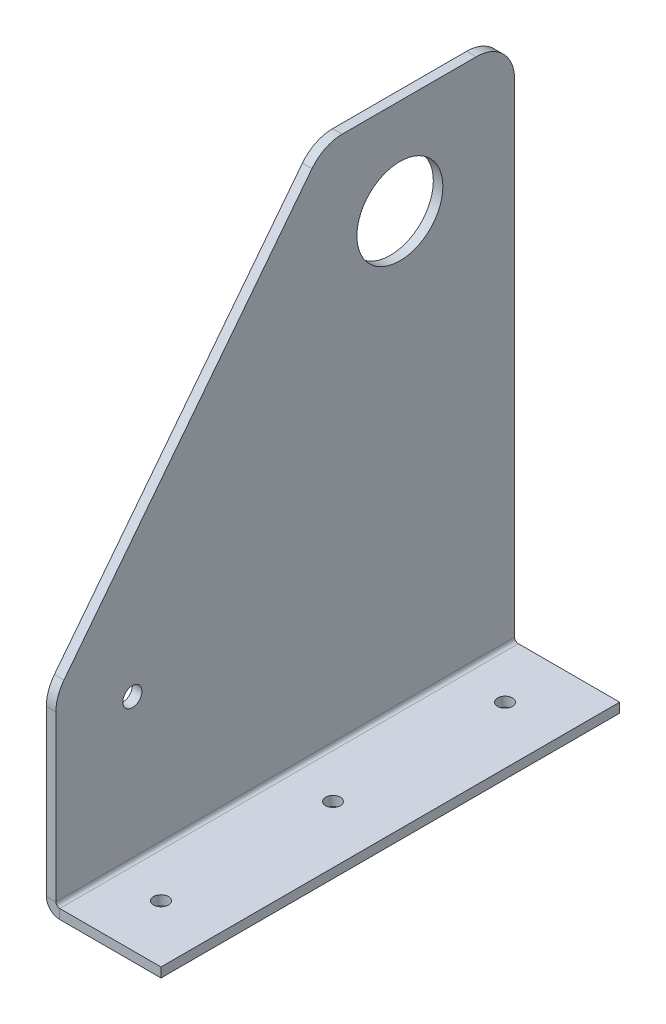
ISO-10303-21;
HEADER;
FILE_DESCRIPTION(('STEP AP214'),'2;1');
FILE_NAME('part.step','',(''),(''),'','','');
FILE_SCHEMA(('AUTOMOTIVE_DESIGN { 1 0 10303 214 1 1 1 1 }'));
ENDSEC;
DATA;
#1=APPLICATION_CONTEXT('core data for automotive mechanical design processes');
#2=APPLICATION_PROTOCOL_DEFINITION('international standard','automotive_design',2000,#1);
#3=PRODUCT_CONTEXT('',#1,'mechanical');
#4=PRODUCT('Part','Part','',(#3));
#5=PRODUCT_RELATED_PRODUCT_CATEGORY('part','',(#4));
#6=PRODUCT_DEFINITION_FORMATION('','',#4);
#7=PRODUCT_DEFINITION_CONTEXT('part definition',#1,'design');
#8=PRODUCT_DEFINITION('design','',#6,#7);
#9=PRODUCT_DEFINITION_SHAPE('','',#8);
#10=(LENGTH_UNIT() NAMED_UNIT(*) SI_UNIT(.MILLI.,.METRE.));
#11=(NAMED_UNIT(*) PLANE_ANGLE_UNIT() SI_UNIT($,.RADIAN.));
#12=(NAMED_UNIT(*) SI_UNIT($,.STERADIAN.) SOLID_ANGLE_UNIT());
#13=UNCERTAINTY_MEASURE_WITH_UNIT(LENGTH_MEASURE(1.E-05),#10,'distance_accuracy_value','');
#14=(GEOMETRIC_REPRESENTATION_CONTEXT(3) GLOBAL_UNCERTAINTY_ASSIGNED_CONTEXT((#13)) GLOBAL_UNIT_ASSIGNED_CONTEXT((#10,
#11,#12)) REPRESENTATION_CONTEXT('',''));
#15=CARTESIAN_POINT('',(0.,0.,0.));
#16=DIRECTION('',(0.,0.,1.));
#17=DIRECTION('',(1.,0.,0.));
#18=AXIS2_PLACEMENT_3D('',#15,#16,#17);
#19=CARTESIAN_POINT('',(0.,3.175,76.2));
#20=DIRECTION('',(0.,0.,-1.));
#21=DIRECTION('',(-1.,0.,0.));
#22=AXIS2_PLACEMENT_3D('',#19,#20,#21);
#23=PLANE('',#22);
#24=DIRECTION('',(0.,1.,0.));
#25=VECTOR('',#24,1.);
#26=CARTESIAN_POINT('',(4.445,3.175,76.2));
#27=LINE('',#26,#25);
#28=CARTESIAN_POINT('',(4.44499999999999,0.,76.2));
#29=VERTEX_POINT('',#28);
#30=CARTESIAN_POINT('',(4.445,3.175,76.2));
#31=VERTEX_POINT('',#30);
#32=EDGE_CURVE('E11',#29,#31,#27,.T.);
#33=ORIENTED_EDGE('',*,*,#32,.F.);
#34=DIRECTION('',(1.,0.,0.));
#35=VECTOR('',#34,1.);
#36=CARTESIAN_POINT('',(0.,0.,76.2));
#37=LINE('',#36,#35);
#38=CARTESIAN_POINT('',(38.1,0.,76.2));
#39=VERTEX_POINT('',#38);
#40=EDGE_CURVE('E100',#39,#29,#37,.F.);
#41=ORIENTED_EDGE('',*,*,#40,.F.);
#42=DIRECTION('',(0.,1.,0.));
#43=VECTOR('',#42,1.);
#44=CARTESIAN_POINT('',(38.1,3.175,76.2));
#45=LINE('',#44,#43);
#46=CARTESIAN_POINT('',(38.1,3.175,76.2));
#47=VERTEX_POINT('',#46);
#48=EDGE_CURVE('E49',#39,#47,#45,.T.);
#49=ORIENTED_EDGE('',*,*,#48,.T.);
#50=DIRECTION('',(-1.,0.,0.));
#51=VECTOR('',#50,1.);
#52=CARTESIAN_POINT('',(0.,3.175,76.2));
#53=LINE('',#52,#51);
#54=EDGE_CURVE('E102',#47,#31,#53,.T.);
#55=ORIENTED_EDGE('',*,*,#54,.T.);
#56=EDGE_LOOP('',(#33,#41,#49,#55));
#57=FACE_BOUND('',#56,.T.);
#58=ADVANCED_FACE('F39',(#57),#23,.F.);
#59=CARTESIAN_POINT('',(38.1,3.175,-76.2));
#60=DIRECTION('',(-1.,0.,0.));
#61=DIRECTION('',(0.,0.,1.));
#62=AXIS2_PLACEMENT_3D('',#59,#60,#61);
#63=PLANE('',#62);
#64=ORIENTED_EDGE('',*,*,#48,.F.);
#65=DIRECTION('',(0.,0.,1.));
#66=VECTOR('',#65,1.);
#67=CARTESIAN_POINT('',(38.1,0.,-76.2));
#68=LINE('',#67,#66);
#69=CARTESIAN_POINT('',(38.1,0.,-76.2));
#70=VERTEX_POINT('',#69);
#71=EDGE_CURVE('E126',#70,#39,#68,.T.);
#72=ORIENTED_EDGE('',*,*,#71,.F.);
#73=DIRECTION('',(0.,1.,0.));
#74=VECTOR('',#73,1.);
#75=CARTESIAN_POINT('',(38.1,3.175,-76.2));
#76=LINE('',#75,#74);
#77=CARTESIAN_POINT('',(38.1,3.175,-76.2));
#78=VERTEX_POINT('',#77);
#79=EDGE_CURVE('E174',#70,#78,#76,.T.);
#80=ORIENTED_EDGE('',*,*,#79,.T.);
#81=DIRECTION('',(0.,0.,1.));
#82=VECTOR('',#81,1.);
#83=CARTESIAN_POINT('',(38.1,3.175,-76.2));
#84=LINE('',#83,#82);
#85=EDGE_CURVE('E186',#78,#47,#84,.T.);
#86=ORIENTED_EDGE('',*,*,#85,.T.);
#87=EDGE_LOOP('',(#64,#72,#80,#86));
#88=FACE_BOUND('',#87,.T.);
#89=ADVANCED_FACE('F192',(#88),#63,.F.);
#90=CARTESIAN_POINT('',(0.,3.175,-76.2));
#91=DIRECTION('',(0.,0.,-1.));
#92=DIRECTION('',(-1.,0.,0.));
#93=AXIS2_PLACEMENT_3D('',#90,#91,#92);
#94=PLANE('',#93);
#95=ORIENTED_EDGE('',*,*,#79,.F.);
#96=DIRECTION('',(1.,0.,0.));
#97=VECTOR('',#96,1.);
#98=CARTESIAN_POINT('',(0.,0.,-76.2));
#99=LINE('',#98,#97);
#100=CARTESIAN_POINT('',(4.445,0.,-76.2));
#101=VERTEX_POINT('',#100);
#102=EDGE_CURVE('E127',#70,#101,#99,.F.);
#103=ORIENTED_EDGE('',*,*,#102,.T.);
#104=DIRECTION('',(0.,1.,0.));
#105=VECTOR('',#104,1.);
#106=CARTESIAN_POINT('',(4.445,3.175,-76.2));
#107=LINE('',#106,#105);
#108=CARTESIAN_POINT('',(4.445,3.175,-76.2));
#109=VERTEX_POINT('',#108);
#110=EDGE_CURVE('E171',#101,#109,#107,.T.);
#111=ORIENTED_EDGE('',*,*,#110,.T.);
#112=DIRECTION('',(-1.,0.,0.));
#113=VECTOR('',#112,1.);
#114=CARTESIAN_POINT('',(0.,3.175,-76.2));
#115=LINE('',#114,#113);
#116=EDGE_CURVE('E190',#78,#109,#115,.T.);
#117=ORIENTED_EDGE('',*,*,#116,.F.);
#118=EDGE_LOOP('',(#95,#103,#111,#117));
#119=FACE_BOUND('',#118,.T.);
#120=ADVANCED_FACE('F251',(#119),#94,.T.);
#121=CARTESIAN_POINT('',(4.445,4.445,-76.2));
#122=DIRECTION('',(0.,0.,-1.));
#123=DIRECTION('',(0.,1.,0.));
#124=AXIS2_PLACEMENT_3D('',#121,#122,#123);
#125=PLANE('',#124);
#126=ORIENTED_EDGE('',*,*,#110,.F.);
#127=CARTESIAN_POINT('',(4.445,4.445,-76.2));
#128=DIRECTION('',(0.,0.,-1.));
#129=DIRECTION('',(-1.,0.,0.));
#130=AXIS2_PLACEMENT_3D('',#127,#128,#129);
#131=CIRCLE('',#130,4.445);
#132=CARTESIAN_POINT('',(0.,4.44500000000001,-76.2));
#133=VERTEX_POINT('',#132);
#134=EDGE_CURVE('E116',#101,#133,#131,.T.);
#135=ORIENTED_EDGE('',*,*,#134,.T.);
#136=DIRECTION('',(1.,0.,0.));
#137=VECTOR('',#136,1.);
#138=CARTESIAN_POINT('',(3.175,4.445,-76.2));
#139=LINE('',#138,#137);
#140=CARTESIAN_POINT('',(3.175,4.445,-76.2));
#141=VERTEX_POINT('',#140);
#142=EDGE_CURVE('E169',#133,#141,#139,.T.);
#143=ORIENTED_EDGE('',*,*,#142,.T.);
#144=CARTESIAN_POINT('',(4.445,4.445,-76.2));
#145=DIRECTION('',(0.,0.,1.));
#146=DIRECTION('',(0.,-1.,0.));
#147=AXIS2_PLACEMENT_3D('',#144,#145,#146);
#148=CIRCLE('',#147,1.27);
#149=EDGE_CURVE('E226',#109,#141,#148,.F.);
#150=ORIENTED_EDGE('',*,*,#149,.F.);
#151=EDGE_LOOP('',(#126,#135,#143,#150));
#152=FACE_BOUND('',#151,.T.);
#153=ADVANCED_FACE('F304',(#152),#125,.T.);
#154=CARTESIAN_POINT('',(3.175,165.1,-76.2));
#155=DIRECTION('',(0.,0.,-1.));
#156=DIRECTION('',(0.,1.,0.));
#157=AXIS2_PLACEMENT_3D('',#154,#155,#156);
#158=PLANE('',#157);
#159=ORIENTED_EDGE('',*,*,#142,.F.);
#160=DIRECTION('',(0.,1.,0.));
#161=VECTOR('',#160,1.);
#162=CARTESIAN_POINT('',(0.,59.1425315732014,-76.2));
#163=LINE('',#162,#161);
#164=CARTESIAN_POINT('',(0.,165.1,-76.2));
#165=VERTEX_POINT('',#164);
#166=EDGE_CURVE('E247',#133,#165,#163,.T.);
#167=ORIENTED_EDGE('',*,*,#166,.T.);
#168=DIRECTION('',(1.,0.,0.));
#169=VECTOR('',#168,1.);
#170=CARTESIAN_POINT('',(3.175,165.1,-76.2));
#171=LINE('',#170,#169);
#172=CARTESIAN_POINT('',(3.175,165.1,-76.2));
#173=VERTEX_POINT('',#172);
#174=EDGE_CURVE('E166',#165,#173,#171,.T.);
#175=ORIENTED_EDGE('',*,*,#174,.T.);
#176=DIRECTION('',(0.,1.,0.));
#177=VECTOR('',#176,1.);
#178=CARTESIAN_POINT('',(3.175,165.1,-76.2));
#179=LINE('',#178,#177);
#180=EDGE_CURVE('E193',#141,#173,#179,.T.);
#181=ORIENTED_EDGE('',*,*,#180,.F.);
#182=EDGE_LOOP('',(#159,#167,#175,#181));
#183=FACE_BOUND('',#182,.T.);
#184=ADVANCED_FACE('F307',(#183),#158,.T.);
#185=CARTESIAN_POINT('',(3.175,165.1,-63.5));
#186=DIRECTION('',(1.,0.,0.));
#187=DIRECTION('',(0.,0.,-1.));
#188=AXIS2_PLACEMENT_3D('',#185,#186,#187);
#189=CYLINDRICAL_SURFACE('',#188,12.7);
#190=ORIENTED_EDGE('',*,*,#174,.F.);
#191=CARTESIAN_POINT('',(0.,165.1,-63.5));
#192=DIRECTION('',(1.,0.,0.));
#193=DIRECTION('',(0.,0.,-1.));
#194=AXIS2_PLACEMENT_3D('',#191,#192,#193);
#195=CIRCLE('',#194,12.7);
#196=CARTESIAN_POINT('',(0.,177.8,-63.4999999999999));
#197=VERTEX_POINT('',#196);
#198=EDGE_CURVE('E244',#165,#197,#195,.T.);
#199=ORIENTED_EDGE('',*,*,#198,.T.);
#200=DIRECTION('',(1.,0.,0.));
#201=VECTOR('',#200,1.);
#202=CARTESIAN_POINT('',(3.175,177.8,-63.4999999999999));
#203=LINE('',#202,#201);
#204=CARTESIAN_POINT('',(3.175,177.8,-63.4999999999999));
#205=VERTEX_POINT('',#204);
#206=EDGE_CURVE('E163',#197,#205,#203,.T.);
#207=ORIENTED_EDGE('',*,*,#206,.T.);
#208=CARTESIAN_POINT('',(3.175,165.1,-63.5));
#209=DIRECTION('',(1.,0.,0.));
#210=DIRECTION('',(0.,0.,1.));
#211=AXIS2_PLACEMENT_3D('',#208,#209,#210);
#212=CIRCLE('',#211,12.7);
#213=EDGE_CURVE('E196',#173,#205,#212,.T.);
#214=ORIENTED_EDGE('',*,*,#213,.F.);
#215=EDGE_LOOP('',(#190,#199,#207,#214));
#216=FACE_BOUND('',#215,.T.);
#217=ADVANCED_FACE('F311',(#216),#189,.T.);
#218=CARTESIAN_POINT('',(3.175,177.8,-18.9113643319545));
#219=DIRECTION('',(0.,1.,0.));
#220=DIRECTION('',(0.,0.,1.));
#221=AXIS2_PLACEMENT_3D('',#218,#219,#220);
#222=PLANE('',#221);
#223=ORIENTED_EDGE('',*,*,#206,.F.);
#224=DIRECTION('',(0.,0.,-1.));
#225=VECTOR('',#224,1.);
#226=CARTESIAN_POINT('',(0.,177.8,63.5));
#227=LINE('',#226,#225);
#228=CARTESIAN_POINT('',(0.,177.8,-18.9113643319545));
#229=VERTEX_POINT('',#228);
#230=EDGE_CURVE('E241',#197,#229,#227,.F.);
#231=ORIENTED_EDGE('',*,*,#230,.T.);
#232=DIRECTION('',(1.,0.,0.));
#233=VECTOR('',#232,1.);
#234=CARTESIAN_POINT('',(3.175,177.8,-18.9113643319545));
#235=LINE('',#234,#233);
#236=CARTESIAN_POINT('',(3.175,177.8,-18.9113643319545));
#237=VERTEX_POINT('',#236);
#238=EDGE_CURVE('E160',#229,#237,#235,.T.);
#239=ORIENTED_EDGE('',*,*,#238,.T.);
#240=DIRECTION('',(0.,0.,1.));
#241=VECTOR('',#240,1.);
#242=CARTESIAN_POINT('',(3.175,177.8,-18.9113643319545));
#243=LINE('',#242,#241);
#244=EDGE_CURVE('E202',#205,#237,#243,.T.);
#245=ORIENTED_EDGE('',*,*,#244,.F.);
#246=EDGE_LOOP('',(#223,#231,#239,#245));
#247=FACE_BOUND('',#246,.T.);
#248=ADVANCED_FACE('F315',(#247),#222,.T.);
#249=CARTESIAN_POINT('',(3.175,165.1,-18.9113643319545));
#250=DIRECTION('',(1.,0.,0.));
#251=DIRECTION('',(0.,0.,-1.));
#252=AXIS2_PLACEMENT_3D('',#249,#250,#251);
#253=CYLINDRICAL_SURFACE('',#252,12.7);
#254=ORIENTED_EDGE('',*,*,#238,.F.);
#255=CARTESIAN_POINT('',(0.,165.1,-18.9113643319545));
#256=DIRECTION('',(1.,0.,0.));
#257=DIRECTION('',(0.,0.,-1.));
#258=AXIS2_PLACEMENT_3D('',#255,#256,#257);
#259=CIRCLE('',#258,12.7);
#260=CARTESIAN_POINT('',(0.,172.897045791639,-8.8865911712751));
#261=VERTEX_POINT('',#260);
#262=EDGE_CURVE('E238',#229,#261,#259,.T.);
#263=ORIENTED_EDGE('',*,*,#262,.T.);
#264=DIRECTION('',(1.,0.,0.));
#265=VECTOR('',#264,1.);
#266=CARTESIAN_POINT('',(3.175,172.897045791639,-8.8865911712751));
#267=LINE('',#266,#265);
#268=CARTESIAN_POINT('',(3.175,172.897045791639,-8.8865911712751));
#269=VERTEX_POINT('',#268);
#270=EDGE_CURVE('E157',#261,#269,#267,.T.);
#271=ORIENTED_EDGE('',*,*,#270,.T.);
#272=CARTESIAN_POINT('',(3.175,165.1,-18.9113643319545));
#273=DIRECTION('',(1.,0.,0.));
#274=DIRECTION('',(0.,0.,-1.));
#275=AXIS2_PLACEMENT_3D('',#272,#273,#274);
#276=CIRCLE('',#275,12.7);
#277=EDGE_CURVE('E205',#237,#269,#276,.T.);
#278=ORIENTED_EDGE('',*,*,#277,.F.);
#279=EDGE_LOOP('',(#254,#263,#271,#278));
#280=FACE_BOUND('',#279,.T.);
#281=ADVANCED_FACE('F319',(#280),#253,.T.);
#282=CARTESIAN_POINT('',(3.175,66.9395773648409,73.5247731606793));
#283=DIRECTION('',(0.,0.61394061351492,0.789352217376326));
#284=DIRECTION('',(0.,-0.789352217376326,0.61394061351492));
#285=AXIS2_PLACEMENT_3D('',#282,#283,#284);
#286=PLANE('',#285);
#287=ORIENTED_EDGE('',*,*,#270,.F.);
#288=DIRECTION('',(0.,-0.789352217376326,0.61394061351492));
#289=VECTOR('',#288,1.);
#290=CARTESIAN_POINT('',(0.,66.9395773648409,73.5247731606793));
#291=LINE('',#290,#289);
#292=CARTESIAN_POINT('',(0.,66.9395773648409,73.5247731606793));
#293=VERTEX_POINT('',#292);
#294=EDGE_CURVE('E235',#261,#293,#291,.T.);
#295=ORIENTED_EDGE('',*,*,#294,.T.);
#296=DIRECTION('',(1.,0.,0.));
#297=VECTOR('',#296,1.);
#298=CARTESIAN_POINT('',(3.175,66.9395773648409,73.5247731606793));
#299=LINE('',#298,#297);
#300=CARTESIAN_POINT('',(3.175,66.9395773648409,73.5247731606793));
#301=VERTEX_POINT('',#300);
#302=EDGE_CURVE('E154',#293,#301,#299,.T.);
#303=ORIENTED_EDGE('',*,*,#302,.T.);
#304=DIRECTION('',(0.,-0.789352217376326,0.61394061351492));
#305=VECTOR('',#304,1.);
#306=CARTESIAN_POINT('',(3.175,66.9395773648409,73.5247731606793));
#307=LINE('',#306,#305);
#308=EDGE_CURVE('E208',#269,#301,#307,.T.);
#309=ORIENTED_EDGE('',*,*,#308,.F.);
#310=EDGE_LOOP('',(#287,#295,#303,#309));
#311=FACE_BOUND('',#310,.T.);
#312=ADVANCED_FACE('F323',(#311),#286,.T.);
#313=CARTESIAN_POINT('',(3.175,59.1425315732014,63.5));
#314=DIRECTION('',(1.,0.,0.));
#315=DIRECTION('',(0.,0.,-1.));
#316=AXIS2_PLACEMENT_3D('',#313,#314,#315);
#317=CYLINDRICAL_SURFACE('',#316,12.7);
#318=ORIENTED_EDGE('',*,*,#302,.F.);
#319=CARTESIAN_POINT('',(0.,59.1425315732014,63.5));
#320=DIRECTION('',(1.,0.,0.));
#321=DIRECTION('',(0.,0.,-1.));
#322=AXIS2_PLACEMENT_3D('',#319,#320,#321);
#323=CIRCLE('',#322,12.7);
#324=CARTESIAN_POINT('',(0.,59.1425315732013,76.2));
#325=VERTEX_POINT('',#324);
#326=EDGE_CURVE('E232',#293,#325,#323,.T.);
#327=ORIENTED_EDGE('',*,*,#326,.T.);
#328=DIRECTION('',(1.,0.,0.));
#329=VECTOR('',#328,1.);
#330=CARTESIAN_POINT('',(3.175,59.1425315732013,76.2));
#331=LINE('',#330,#329);
#332=CARTESIAN_POINT('',(3.175,59.1425315732013,76.2));
#333=VERTEX_POINT('',#332);
#334=EDGE_CURVE('E151',#325,#333,#331,.T.);
#335=ORIENTED_EDGE('',*,*,#334,.T.);
#336=CARTESIAN_POINT('',(3.175,59.1425315732014,63.5));
#337=DIRECTION('',(1.,0.,0.));
#338=DIRECTION('',(0.,0.,-1.));
#339=AXIS2_PLACEMENT_3D('',#336,#337,#338);
#340=CIRCLE('',#339,12.7);
#341=EDGE_CURVE('E211',#301,#333,#340,.T.);
#342=ORIENTED_EDGE('',*,*,#341,.F.);
#343=EDGE_LOOP('',(#318,#327,#335,#342));
#344=FACE_BOUND('',#343,.T.);
#345=ADVANCED_FACE('F327',(#344),#317,.T.);
#346=CARTESIAN_POINT('',(3.175,0.,76.2));
#347=DIRECTION('',(0.,0.,1.));
#348=DIRECTION('',(0.,-1.,0.));
#349=AXIS2_PLACEMENT_3D('',#346,#347,#348);
#350=PLANE('',#349);
#351=ORIENTED_EDGE('',*,*,#334,.F.);
#352=DIRECTION('',(0.,1.,0.));
#353=VECTOR('',#352,1.);
#354=CARTESIAN_POINT('',(0.,59.1425315732014,76.2));
#355=LINE('',#354,#353);
#356=CARTESIAN_POINT('',(0.,4.445,76.2));
#357=VERTEX_POINT('',#356);
#358=EDGE_CURVE('E142',#325,#357,#355,.F.);
#359=ORIENTED_EDGE('',*,*,#358,.T.);
#360=DIRECTION('',(1.,0.,0.));
#361=VECTOR('',#360,1.);
#362=CARTESIAN_POINT('',(3.175,4.445,76.2));
#363=LINE('',#362,#361);
#364=CARTESIAN_POINT('',(3.175,4.445,76.2));
#365=VERTEX_POINT('',#364);
#366=EDGE_CURVE('E43',#357,#365,#363,.T.);
#367=ORIENTED_EDGE('',*,*,#366,.T.);
#368=DIRECTION('',(0.,-1.,0.));
#369=VECTOR('',#368,1.);
#370=CARTESIAN_POINT('',(3.175,0.,76.2));
#371=LINE('',#370,#369);
#372=EDGE_CURVE('E214',#333,#365,#371,.T.);
#373=ORIENTED_EDGE('',*,*,#372,.F.);
#374=EDGE_LOOP('',(#351,#359,#367,#373));
#375=FACE_BOUND('',#374,.T.);
#376=ADVANCED_FACE('F331',(#375),#350,.T.);
#377=CARTESIAN_POINT('',(19.05,3.175,57.15));
#378=DIRECTION('',(0.,1.,0.));
#379=DIRECTION('',(0.,0.,1.));
#380=AXIS2_PLACEMENT_3D('',#377,#378,#379);
#381=CYLINDRICAL_SURFACE('',#380,2.45745);
#382=CARTESIAN_POINT('',(19.05,3.175,57.15));
#383=DIRECTION('',(0.,1.,0.));
#384=DIRECTION('',(0.,0.,1.));
#385=AXIS2_PLACEMENT_3D('',#382,#383,#384);
#386=CIRCLE('',#385,2.45745);
#387=CARTESIAN_POINT('',(19.05,3.175,59.60745));
#388=VERTEX_POINT('',#387);
#389=EDGE_CURVE('E229',#388,#388,#386,.T.);
#390=ORIENTED_EDGE('',*,*,#389,.T.);
#391=EDGE_LOOP('',(#390));
#392=FACE_BOUND('',#391,.T.);
#393=CARTESIAN_POINT('',(19.05,0.,57.15));
#394=DIRECTION('',(0.,1.,0.));
#395=DIRECTION('',(0.,0.,1.));
#396=AXIS2_PLACEMENT_3D('',#393,#394,#395);
#397=CIRCLE('',#396,2.45745);
#398=CARTESIAN_POINT('',(19.05,0.,59.60745));
#399=VERTEX_POINT('',#398);
#400=EDGE_CURVE('E133',#399,#399,#397,.T.);
#401=ORIENTED_EDGE('',*,*,#400,.F.);
#402=EDGE_LOOP('',(#401));
#403=FACE_BOUND('',#402,.T.);
#404=ADVANCED_FACE('F335',(#392,#403),#381,.F.);
#405=CARTESIAN_POINT('',(19.05,3.175,0.));
#406=DIRECTION('',(0.,1.,0.));
#407=DIRECTION('',(0.,0.,1.));
#408=AXIS2_PLACEMENT_3D('',#405,#406,#407);
#409=CYLINDRICAL_SURFACE('',#408,2.45745);
#410=CARTESIAN_POINT('',(19.05,3.175,0.));
#411=DIRECTION('',(0.,1.,0.));
#412=DIRECTION('',(0.,0.,1.));
#413=AXIS2_PLACEMENT_3D('',#410,#411,#412);
#414=CIRCLE('',#413,2.45745);
#415=CARTESIAN_POINT('',(19.05,3.175,2.45745));
#416=VERTEX_POINT('',#415);
#417=EDGE_CURVE('E258',#416,#416,#414,.T.);
#418=ORIENTED_EDGE('',*,*,#417,.T.);
#419=EDGE_LOOP('',(#418));
#420=FACE_BOUND('',#419,.T.);
#421=CARTESIAN_POINT('',(19.05,0.,0.));
#422=DIRECTION('',(0.,1.,0.));
#423=DIRECTION('',(0.,0.,1.));
#424=AXIS2_PLACEMENT_3D('',#421,#422,#423);
#425=CIRCLE('',#424,2.45745);
#426=CARTESIAN_POINT('',(19.05,0.,2.45745));
#427=VERTEX_POINT('',#426);
#428=EDGE_CURVE('E145',#427,#427,#425,.T.);
#429=ORIENTED_EDGE('',*,*,#428,.F.);
#430=EDGE_LOOP('',(#429));
#431=FACE_BOUND('',#430,.T.);
#432=ADVANCED_FACE('F418',(#420,#431),#409,.F.);
#433=CARTESIAN_POINT('',(19.05,3.175,-57.15));
#434=DIRECTION('',(0.,1.,0.));
#435=DIRECTION('',(0.,0.,1.));
#436=AXIS2_PLACEMENT_3D('',#433,#434,#435);
#437=CYLINDRICAL_SURFACE('',#436,2.45745);
#438=CARTESIAN_POINT('',(19.05,3.175,-57.15));
#439=DIRECTION('',(0.,1.,0.));
#440=DIRECTION('',(0.,0.,1.));
#441=AXIS2_PLACEMENT_3D('',#438,#439,#440);
#442=CIRCLE('',#441,2.45745);
#443=CARTESIAN_POINT('',(19.05,3.175,-54.69255));
#444=VERTEX_POINT('',#443);
#445=EDGE_CURVE('E256',#444,#444,#442,.T.);
#446=ORIENTED_EDGE('',*,*,#445,.T.);
#447=EDGE_LOOP('',(#446));
#448=FACE_BOUND('',#447,.T.);
#449=CARTESIAN_POINT('',(19.05,0.,-57.15));
#450=DIRECTION('',(0.,1.,0.));
#451=DIRECTION('',(0.,0.,1.));
#452=AXIS2_PLACEMENT_3D('',#449,#450,#451);
#453=CIRCLE('',#452,2.45745);
#454=CARTESIAN_POINT('',(19.05,0.,-54.69255));
#455=VERTEX_POINT('',#454);
#456=EDGE_CURVE('E148',#455,#455,#453,.T.);
#457=ORIENTED_EDGE('',*,*,#456,.F.);
#458=EDGE_LOOP('',(#457));
#459=FACE_BOUND('',#458,.T.);
#460=ADVANCED_FACE('F41',(#448,#459),#437,.F.);
#461=CARTESIAN_POINT('',(4.445,4.445,76.2));
#462=DIRECTION('',(0.,0.,-1.));
#463=DIRECTION('',(-1.,0.,0.));
#464=AXIS2_PLACEMENT_3D('',#461,#462,#463);
#465=PLANE('',#464);
#466=CARTESIAN_POINT('',(4.445,4.445,76.2));
#467=DIRECTION('',(0.,0.,-1.));
#468=DIRECTION('',(-1.,0.,0.));
#469=AXIS2_PLACEMENT_3D('',#466,#467,#468);
#470=CIRCLE('',#469,4.445);
#471=EDGE_CURVE('E114',#357,#29,#470,.F.);
#472=ORIENTED_EDGE('',*,*,#471,.T.);
#473=ORIENTED_EDGE('',*,*,#32,.T.);
#474=CARTESIAN_POINT('',(4.445,4.445,76.2));
#475=DIRECTION('',(0.,0.,1.));
#476=DIRECTION('',(1.,0.,0.));
#477=AXIS2_PLACEMENT_3D('',#474,#475,#476);
#478=CIRCLE('',#477,1.27);
#479=EDGE_CURVE('E224',#365,#31,#478,.T.);
#480=ORIENTED_EDGE('',*,*,#479,.F.);
#481=ORIENTED_EDGE('',*,*,#366,.F.);
#482=EDGE_LOOP('',(#472,#473,#480,#481));
#483=FACE_BOUND('',#482,.T.);
#484=ADVANCED_FACE('F129',(#483),#465,.F.);
#485=CARTESIAN_POINT('',(3.175,146.05,-38.1));
#486=DIRECTION('',(1.,0.,0.));
#487=DIRECTION('',(0.,0.,-1.));
#488=AXIS2_PLACEMENT_3D('',#485,#486,#487);
#489=CYLINDRICAL_SURFACE('',#488,14.2875);
#490=CARTESIAN_POINT('',(3.175,146.05,-38.1));
#491=DIRECTION('',(1.,0.,0.));
#492=DIRECTION('',(0.,0.,-1.));
#493=AXIS2_PLACEMENT_3D('',#490,#491,#492);
#494=CIRCLE('',#493,14.2875);
#495=CARTESIAN_POINT('',(3.175,146.05,-52.3875));
#496=VERTEX_POINT('',#495);
#497=EDGE_CURVE('E217',#496,#496,#494,.T.);
#498=ORIENTED_EDGE('',*,*,#497,.T.);
#499=EDGE_LOOP('',(#498));
#500=FACE_BOUND('',#499,.T.);
#501=CARTESIAN_POINT('',(0.,146.05,-38.1));
#502=DIRECTION('',(1.,0.,0.));
#503=DIRECTION('',(0.,0.,-1.));
#504=AXIS2_PLACEMENT_3D('',#501,#502,#503);
#505=CIRCLE('',#504,14.2875);
#506=CARTESIAN_POINT('',(0.,146.05,-52.3875));
#507=VERTEX_POINT('',#506);
#508=EDGE_CURVE('E121',#507,#507,#505,.T.);
#509=ORIENTED_EDGE('',*,*,#508,.F.);
#510=EDGE_LOOP('',(#509));
#511=FACE_BOUND('',#510,.T.);
#512=ADVANCED_FACE('F280',(#500,#511),#489,.F.);
#513=CARTESIAN_POINT('',(3.175,59.1425315732014,63.5));
#514=DIRECTION('',(1.,0.,0.));
#515=DIRECTION('',(0.,0.,-1.));
#516=AXIS2_PLACEMENT_3D('',#513,#514,#515);
#517=PLANE('',#516);
#518=CARTESIAN_POINT('',(3.175,50.8,50.8));
#519=DIRECTION('',(1.,0.,0.));
#520=DIRECTION('',(0.,0.,-1.));
#521=AXIS2_PLACEMENT_3D('',#518,#519,#520);
#522=CIRCLE('',#521,3.175);
#523=CARTESIAN_POINT('',(3.175,50.8,47.625));
#524=VERTEX_POINT('',#523);
#525=EDGE_CURVE('E131',#524,#524,#522,.T.);
#526=ORIENTED_EDGE('',*,*,#525,.F.);
#527=EDGE_LOOP('',(#526));
#528=FACE_BOUND('',#527,.T.);
#529=ORIENTED_EDGE('',*,*,#372,.T.);
#530=DIRECTION('',(0.,0.,1.));
#531=VECTOR('',#530,1.);
#532=CARTESIAN_POINT('',(3.175,4.445,-76.2));
#533=LINE('',#532,#531);
#534=EDGE_CURVE('E221',#365,#141,#533,.F.);
#535=ORIENTED_EDGE('',*,*,#534,.T.);
#536=ORIENTED_EDGE('',*,*,#180,.T.);
#537=ORIENTED_EDGE('',*,*,#213,.T.);
#538=ORIENTED_EDGE('',*,*,#244,.T.);
#539=ORIENTED_EDGE('',*,*,#277,.T.);
#540=ORIENTED_EDGE('',*,*,#308,.T.);
#541=ORIENTED_EDGE('',*,*,#341,.T.);
#542=EDGE_LOOP('',(#529,#535,#536,#537,#538,#539,#540,#541));
#543=FACE_BOUND('',#542,.T.);
#544=ORIENTED_EDGE('',*,*,#497,.F.);
#545=EDGE_LOOP('',(#544));
#546=FACE_BOUND('',#545,.T.);
#547=ADVANCED_FACE('F282',(#528,#543,#546),#517,.T.);
#548=CARTESIAN_POINT('',(0.,3.175,-76.2));
#549=DIRECTION('',(0.,1.,0.));
#550=DIRECTION('',(0.,0.,1.));
#551=AXIS2_PLACEMENT_3D('',#548,#549,#550);
#552=PLANE('',#551);
#553=ORIENTED_EDGE('',*,*,#389,.F.);
#554=EDGE_LOOP('',(#553));
#555=FACE_BOUND('',#554,.T.);
#556=ORIENTED_EDGE('',*,*,#417,.F.);
#557=EDGE_LOOP('',(#556));
#558=FACE_BOUND('',#557,.T.);
#559=ORIENTED_EDGE('',*,*,#445,.F.);
#560=EDGE_LOOP('',(#559));
#561=FACE_BOUND('',#560,.T.);
#562=ORIENTED_EDGE('',*,*,#116,.T.);
#563=DIRECTION('',(0.,0.,1.));
#564=VECTOR('',#563,1.);
#565=CARTESIAN_POINT('',(4.445,3.175,76.2));
#566=LINE('',#565,#564);
#567=EDGE_CURVE('E189',#109,#31,#566,.T.);
#568=ORIENTED_EDGE('',*,*,#567,.T.);
#569=ORIENTED_EDGE('',*,*,#54,.F.);
#570=ORIENTED_EDGE('',*,*,#85,.F.);
#571=EDGE_LOOP('',(#562,#568,#569,#570));
#572=FACE_BOUND('',#571,.T.);
#573=ADVANCED_FACE('F185',(#555,#558,#561,#572),#552,.T.);
#574=CARTESIAN_POINT('',(4.445,4.445,-76.2));
#575=DIRECTION('',(0.,0.,-1.));
#576=DIRECTION('',(-1.,0.,0.));
#577=AXIS2_PLACEMENT_3D('',#574,#575,#576);
#578=CYLINDRICAL_SURFACE('',#577,1.27);
#579=ORIENTED_EDGE('',*,*,#149,.T.);
#580=ORIENTED_EDGE('',*,*,#534,.F.);
#581=ORIENTED_EDGE('',*,*,#479,.T.);
#582=ORIENTED_EDGE('',*,*,#567,.F.);
#583=EDGE_LOOP('',(#579,#580,#581,#582));
#584=FACE_BOUND('',#583,.T.);
#585=ADVANCED_FACE('F273',(#584),#578,.F.);
#586=CARTESIAN_POINT('',(0.,59.1425315732014,63.5));
#587=DIRECTION('',(1.,0.,0.));
#588=DIRECTION('',(0.,0.,-1.));
#589=AXIS2_PLACEMENT_3D('',#586,#587,#588);
#590=PLANE('',#589);
#591=CARTESIAN_POINT('',(0.,50.8,50.8));
#592=DIRECTION('',(-1.,0.,0.));
#593=DIRECTION('',(0.,0.,1.));
#594=AXIS2_PLACEMENT_3D('',#591,#592,#593);
#595=CIRCLE('',#594,3.175);
#596=CARTESIAN_POINT('',(0.,50.8,53.975));
#597=VERTEX_POINT('',#596);
#598=EDGE_CURVE('E136',#597,#597,#595,.T.);
#599=ORIENTED_EDGE('',*,*,#598,.F.);
#600=EDGE_LOOP('',(#599));
#601=FACE_BOUND('',#600,.T.);
#602=ORIENTED_EDGE('',*,*,#358,.F.);
#603=ORIENTED_EDGE('',*,*,#326,.F.);
#604=ORIENTED_EDGE('',*,*,#294,.F.);
#605=ORIENTED_EDGE('',*,*,#262,.F.);
#606=ORIENTED_EDGE('',*,*,#230,.F.);
#607=ORIENTED_EDGE('',*,*,#198,.F.);
#608=ORIENTED_EDGE('',*,*,#166,.F.);
#609=DIRECTION('',(0.,0.,-1.));
#610=VECTOR('',#609,1.);
#611=CARTESIAN_POINT('',(0.,4.445,63.5));
#612=LINE('',#611,#610);
#613=EDGE_CURVE('E120',#357,#133,#612,.T.);
#614=ORIENTED_EDGE('',*,*,#613,.F.);
#615=EDGE_LOOP('',(#602,#603,#604,#605,#606,#607,#608,#614));
#616=FACE_BOUND('',#615,.T.);
#617=ORIENTED_EDGE('',*,*,#508,.T.);
#618=EDGE_LOOP('',(#617));
#619=FACE_BOUND('',#618,.T.);
#620=ADVANCED_FACE('F270',(#601,#616,#619),#590,.F.);
#621=CARTESIAN_POINT('',(0.,0.,-76.2));
#622=DIRECTION('',(0.,1.,0.));
#623=DIRECTION('',(0.,0.,1.));
#624=AXIS2_PLACEMENT_3D('',#621,#622,#623);
#625=PLANE('',#624);
#626=ORIENTED_EDGE('',*,*,#400,.T.);
#627=EDGE_LOOP('',(#626));
#628=FACE_BOUND('',#627,.T.);
#629=ORIENTED_EDGE('',*,*,#428,.T.);
#630=EDGE_LOOP('',(#629));
#631=FACE_BOUND('',#630,.T.);
#632=ORIENTED_EDGE('',*,*,#456,.T.);
#633=EDGE_LOOP('',(#632));
#634=FACE_BOUND('',#633,.T.);
#635=ORIENTED_EDGE('',*,*,#102,.F.);
#636=ORIENTED_EDGE('',*,*,#71,.T.);
#637=ORIENTED_EDGE('',*,*,#40,.T.);
#638=DIRECTION('',(0.,0.,1.));
#639=VECTOR('',#638,1.);
#640=CARTESIAN_POINT('',(4.445,0.,-76.2));
#641=LINE('',#640,#639);
#642=EDGE_CURVE('E111',#101,#29,#641,.T.);
#643=ORIENTED_EDGE('',*,*,#642,.F.);
#644=EDGE_LOOP('',(#635,#636,#637,#643));
#645=FACE_BOUND('',#644,.T.);
#646=ADVANCED_FACE('F124',(#628,#631,#634,#645),#625,.F.);
#647=CARTESIAN_POINT('',(4.445,4.445,-76.2));
#648=DIRECTION('',(0.,0.,-1.));
#649=DIRECTION('',(-1.,0.,0.));
#650=AXIS2_PLACEMENT_3D('',#647,#648,#649);
#651=CYLINDRICAL_SURFACE('',#650,4.445);
#652=ORIENTED_EDGE('',*,*,#134,.F.);
#653=ORIENTED_EDGE('',*,*,#642,.T.);
#654=ORIENTED_EDGE('',*,*,#471,.F.);
#655=ORIENTED_EDGE('',*,*,#613,.T.);
#656=EDGE_LOOP('',(#652,#653,#654,#655));
#657=FACE_BOUND('',#656,.T.);
#658=ADVANCED_FACE('F112',(#657),#651,.T.);
#659=CARTESIAN_POINT('',(38.1,50.8,50.8));
#660=DIRECTION('',(-1.,0.,0.));
#661=DIRECTION('',(0.,0.,1.));
#662=AXIS2_PLACEMENT_3D('',#659,#660,#661);
#663=CYLINDRICAL_SURFACE('',#662,3.175);
#664=ORIENTED_EDGE('',*,*,#525,.T.);
#665=EDGE_LOOP('',(#664));
#666=FACE_BOUND('',#665,.T.);
#667=ORIENTED_EDGE('',*,*,#598,.T.);
#668=EDGE_LOOP('',(#667));
#669=FACE_BOUND('',#668,.T.);
#670=ADVANCED_FACE('F268',(#666,#669),#663,.F.);
#671=CLOSED_SHELL('',(#58,#89,#120,#153,#184,#217,#248,#281,#312,#345,#376,#404,#432,#460,#484,
#512,#547,#573,#585,#620,#646,#658,#670));
#672=MANIFOLD_SOLID_BREP('B2',#671);
#673=ADVANCED_BREP_SHAPE_REPRESENTATION('',(#18,#672),#14);
#674=SHAPE_DEFINITION_REPRESENTATION(#9,#673);
ENDSEC;
END-ISO-10303-21;
